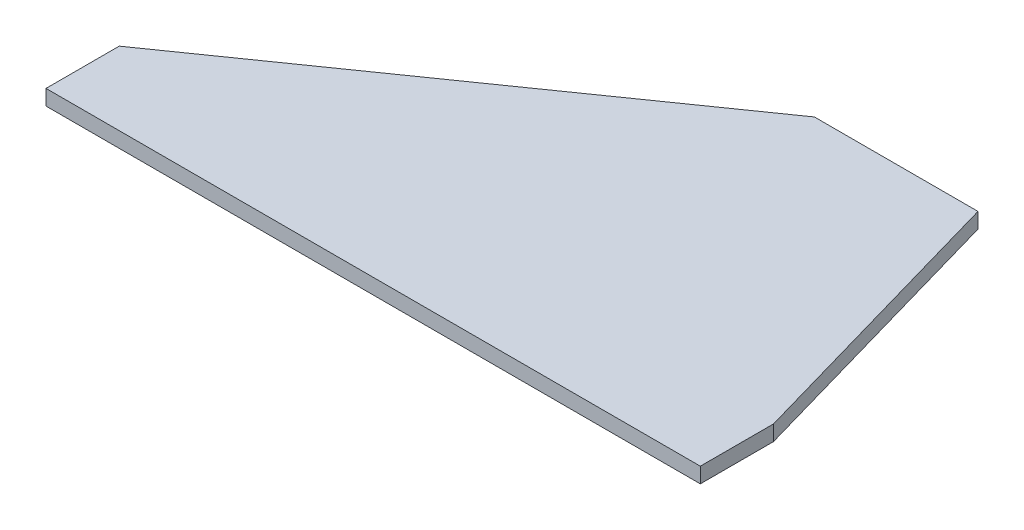
ISO-10303-21;
HEADER;
FILE_DESCRIPTION(('STEP AP214'),'2;1');
FILE_NAME('part.step','',(''),(''),'','','');
FILE_SCHEMA(('AUTOMOTIVE_DESIGN { 1 0 10303 214 1 1 1 1 }'));
ENDSEC;
DATA;
#1=APPLICATION_CONTEXT('core data for automotive mechanical design processes');
#2=APPLICATION_PROTOCOL_DEFINITION('international standard','automotive_design',2000,#1);
#3=PRODUCT_CONTEXT('',#1,'mechanical');
#4=PRODUCT('Part','Part','',(#3));
#5=PRODUCT_RELATED_PRODUCT_CATEGORY('part','',(#4));
#6=PRODUCT_DEFINITION_FORMATION('','',#4);
#7=PRODUCT_DEFINITION_CONTEXT('part definition',#1,'design');
#8=PRODUCT_DEFINITION('design','',#6,#7);
#9=PRODUCT_DEFINITION_SHAPE('','',#8);
#10=(LENGTH_UNIT() NAMED_UNIT(*) SI_UNIT(.MILLI.,.METRE.));
#11=(NAMED_UNIT(*) PLANE_ANGLE_UNIT() SI_UNIT($,.RADIAN.));
#12=(NAMED_UNIT(*) SI_UNIT($,.STERADIAN.) SOLID_ANGLE_UNIT());
#13=UNCERTAINTY_MEASURE_WITH_UNIT(LENGTH_MEASURE(1.E-05),#10,'distance_accuracy_value','');
#14=(GEOMETRIC_REPRESENTATION_CONTEXT(3) GLOBAL_UNCERTAINTY_ASSIGNED_CONTEXT((#13)) GLOBAL_UNIT_ASSIGNED_CONTEXT((#10,
#11,#12)) REPRESENTATION_CONTEXT('',''));
#15=CARTESIAN_POINT('',(0.,0.,0.));
#16=DIRECTION('',(0.,0.,1.));
#17=DIRECTION('',(1.,0.,0.));
#18=AXIS2_PLACEMENT_3D('',#15,#16,#17);
#19=CARTESIAN_POINT('',(127.,-2.38125,-111.633));
#20=DIRECTION('',(0.,0.,1.));
#21=DIRECTION('',(1.,0.,0.));
#22=AXIS2_PLACEMENT_3D('',#19,#20,#21);
#23=PLANE('',#22);
#24=DIRECTION('',(0.,1.,0.));
#25=VECTOR('',#24,1.);
#26=CARTESIAN_POINT('',(127.,-2.38125,-111.633));
#27=LINE('',#26,#25);
#28=CARTESIAN_POINT('',(127.,-2.38125,-111.633));
#29=VERTEX_POINT('',#28);
#30=CARTESIAN_POINT('',(127.,2.38125,-111.633));
#31=VERTEX_POINT('',#30);
#32=EDGE_CURVE('E103',#29,#31,#27,.T.);
#33=ORIENTED_EDGE('',*,*,#32,.T.);
#34=DIRECTION('',(1.,0.,0.));
#35=VECTOR('',#34,1.);
#36=CARTESIAN_POINT('',(127.,2.38125,-111.633));
#37=LINE('',#36,#35);
#38=CARTESIAN_POINT('',(177.8,2.38125,-111.633));
#39=VERTEX_POINT('',#38);
#40=EDGE_CURVE('E97',#31,#39,#37,.T.);
#41=ORIENTED_EDGE('',*,*,#40,.T.);
#42=DIRECTION('',(0.,1.,0.));
#43=VECTOR('',#42,1.);
#44=CARTESIAN_POINT('',(177.8,-2.38125,-111.633));
#45=LINE('',#44,#43);
#46=CARTESIAN_POINT('',(177.8,-2.38125,-111.633));
#47=VERTEX_POINT('',#46);
#48=EDGE_CURVE('E11',#47,#39,#45,.T.);
#49=ORIENTED_EDGE('',*,*,#48,.F.);
#50=DIRECTION('',(1.,0.,0.));
#51=VECTOR('',#50,1.);
#52=CARTESIAN_POINT('',(127.,-2.38125,-111.633));
#53=LINE('',#52,#51);
#54=EDGE_CURVE('E115',#29,#47,#53,.T.);
#55=ORIENTED_EDGE('',*,*,#54,.F.);
#56=EDGE_LOOP('',(#33,#41,#49,#55));
#57=FACE_BOUND('',#56,.T.);
#58=ADVANCED_FACE('F33',(#57),#23,.F.);
#59=CARTESIAN_POINT('',(177.8,-2.38125,-111.633));
#60=DIRECTION('',(-0.961523947640823,0.,0.274721127897378));
#61=DIRECTION('',(0.274721127897378,0.,0.961523947640823));
#62=AXIS2_PLACEMENT_3D('',#59,#60,#61);
#63=PLANE('',#62);
#64=ORIENTED_EDGE('',*,*,#48,.T.);
#65=DIRECTION('',(0.274721127897378,0.,0.961523947640823));
#66=VECTOR('',#65,1.);
#67=CARTESIAN_POINT('',(177.8,2.38125,-111.633));
#68=LINE('',#67,#66);
#69=CARTESIAN_POINT('',(203.2,2.38125,-22.733));
#70=VERTEX_POINT('',#69);
#71=EDGE_CURVE('E87',#39,#70,#68,.T.);
#72=ORIENTED_EDGE('',*,*,#71,.T.);
#73=DIRECTION('',(0.,1.,0.));
#74=VECTOR('',#73,1.);
#75=CARTESIAN_POINT('',(203.2,-2.38125,-22.733));
#76=LINE('',#75,#74);
#77=CARTESIAN_POINT('',(203.2,-2.38125,-22.733));
#78=VERTEX_POINT('',#77);
#79=EDGE_CURVE('E40',#78,#70,#76,.T.);
#80=ORIENTED_EDGE('',*,*,#79,.F.);
#81=DIRECTION('',(0.274721127897378,0.,0.961523947640823));
#82=VECTOR('',#81,1.);
#83=CARTESIAN_POINT('',(177.8,-2.38125,-111.633));
#84=LINE('',#83,#82);
#85=EDGE_CURVE('E88',#47,#78,#84,.T.);
#86=ORIENTED_EDGE('',*,*,#85,.F.);
#87=EDGE_LOOP('',(#64,#72,#80,#86));
#88=FACE_BOUND('',#87,.T.);
#89=ADVANCED_FACE('F85',(#88),#63,.F.);
#90=CARTESIAN_POINT('',(203.2,-2.38125,-22.733));
#91=DIRECTION('',(-1.,0.,0.));
#92=DIRECTION('',(0.,0.,1.));
#93=AXIS2_PLACEMENT_3D('',#90,#91,#92);
#94=PLANE('',#93);
#95=ORIENTED_EDGE('',*,*,#79,.T.);
#96=DIRECTION('',(0.,0.,1.));
#97=VECTOR('',#96,1.);
#98=CARTESIAN_POINT('',(203.2,2.38125,-22.733));
#99=LINE('',#98,#97);
#100=CARTESIAN_POINT('',(203.2,2.38125,0.));
#101=VERTEX_POINT('',#100);
#102=EDGE_CURVE('E101',#70,#101,#99,.T.);
#103=ORIENTED_EDGE('',*,*,#102,.T.);
#104=DIRECTION('',(0.,1.,0.));
#105=VECTOR('',#104,1.);
#106=CARTESIAN_POINT('',(203.2,-2.38125,0.));
#107=LINE('',#106,#105);
#108=CARTESIAN_POINT('',(203.2,-2.38125,0.));
#109=VERTEX_POINT('',#108);
#110=EDGE_CURVE('E129',#109,#101,#107,.T.);
#111=ORIENTED_EDGE('',*,*,#110,.F.);
#112=DIRECTION('',(0.,0.,1.));
#113=VECTOR('',#112,1.);
#114=CARTESIAN_POINT('',(203.2,-2.38125,-22.733));
#115=LINE('',#114,#113);
#116=EDGE_CURVE('E118',#78,#109,#115,.T.);
#117=ORIENTED_EDGE('',*,*,#116,.F.);
#118=EDGE_LOOP('',(#95,#103,#111,#117));
#119=FACE_BOUND('',#118,.T.);
#120=ADVANCED_FACE('F132',(#119),#94,.F.);
#121=CARTESIAN_POINT('',(203.2,-2.38125,0.));
#122=DIRECTION('',(0.,0.,-1.));
#123=DIRECTION('',(-1.,0.,0.));
#124=AXIS2_PLACEMENT_3D('',#121,#122,#123);
#125=PLANE('',#124);
#126=ORIENTED_EDGE('',*,*,#110,.T.);
#127=DIRECTION('',(-1.,0.,0.));
#128=VECTOR('',#127,1.);
#129=CARTESIAN_POINT('',(203.2,2.38125,0.));
#130=LINE('',#129,#128);
#131=CARTESIAN_POINT('',(0.,2.38125,0.));
#132=VERTEX_POINT('',#131);
#133=EDGE_CURVE('E107',#101,#132,#130,.T.);
#134=ORIENTED_EDGE('',*,*,#133,.T.);
#135=DIRECTION('',(0.,1.,0.));
#136=VECTOR('',#135,1.);
#137=CARTESIAN_POINT('',(0.,-2.38125,0.));
#138=LINE('',#137,#136);
#139=CARTESIAN_POINT('',(0.,-2.38125,0.));
#140=VERTEX_POINT('',#139);
#141=EDGE_CURVE('E127',#140,#132,#138,.T.);
#142=ORIENTED_EDGE('',*,*,#141,.F.);
#143=DIRECTION('',(-1.,0.,0.));
#144=VECTOR('',#143,1.);
#145=CARTESIAN_POINT('',(203.2,-2.38125,0.));
#146=LINE('',#145,#144);
#147=EDGE_CURVE('E120',#109,#140,#146,.T.);
#148=ORIENTED_EDGE('',*,*,#147,.F.);
#149=EDGE_LOOP('',(#126,#134,#142,#148));
#150=FACE_BOUND('',#149,.T.);
#151=ADVANCED_FACE('F138',(#150),#125,.F.);
#152=CARTESIAN_POINT('',(0.,-2.38125,0.));
#153=DIRECTION('',(1.,0.,0.));
#154=DIRECTION('',(0.,0.,-1.));
#155=AXIS2_PLACEMENT_3D('',#152,#153,#154);
#156=PLANE('',#155);
#157=ORIENTED_EDGE('',*,*,#141,.T.);
#158=DIRECTION('',(0.,0.,-1.));
#159=VECTOR('',#158,1.);
#160=CARTESIAN_POINT('',(0.,2.38125,0.));
#161=LINE('',#160,#159);
#162=CARTESIAN_POINT('',(0.,2.38125,-22.733));
#163=VERTEX_POINT('',#162);
#164=EDGE_CURVE('E110',#132,#163,#161,.T.);
#165=ORIENTED_EDGE('',*,*,#164,.T.);
#166=DIRECTION('',(0.,1.,0.));
#167=VECTOR('',#166,1.);
#168=CARTESIAN_POINT('',(0.,-2.38125,-22.733));
#169=LINE('',#168,#167);
#170=CARTESIAN_POINT('',(0.,-2.38125,-22.733));
#171=VERTEX_POINT('',#170);
#172=EDGE_CURVE('E125',#171,#163,#169,.T.);
#173=ORIENTED_EDGE('',*,*,#172,.F.);
#174=DIRECTION('',(0.,0.,-1.));
#175=VECTOR('',#174,1.);
#176=CARTESIAN_POINT('',(0.,-2.38125,0.));
#177=LINE('',#176,#175);
#178=EDGE_CURVE('E52',#140,#171,#177,.T.);
#179=ORIENTED_EDGE('',*,*,#178,.F.);
#180=EDGE_LOOP('',(#157,#165,#173,#179));
#181=FACE_BOUND('',#180,.T.);
#182=ADVANCED_FACE('F141',(#181),#156,.F.);
#183=CARTESIAN_POINT('',(0.,-2.38125,-22.733));
#184=DIRECTION('',(0.573462344363328,0.,0.81923192051904));
#185=DIRECTION('',(0.81923192051904,0.,-0.573462344363328));
#186=AXIS2_PLACEMENT_3D('',#183,#184,#185);
#187=PLANE('',#186);
#188=ORIENTED_EDGE('',*,*,#172,.T.);
#189=DIRECTION('',(0.81923192051904,0.,-0.573462344363328));
#190=VECTOR('',#189,1.);
#191=CARTESIAN_POINT('',(0.,2.38125,-22.733));
#192=LINE('',#191,#190);
#193=EDGE_CURVE('E113',#163,#31,#192,.T.);
#194=ORIENTED_EDGE('',*,*,#193,.T.);
#195=ORIENTED_EDGE('',*,*,#32,.F.);
#196=DIRECTION('',(0.81923192051904,0.,-0.573462344363328));
#197=VECTOR('',#196,1.);
#198=CARTESIAN_POINT('',(0.,-2.38125,-22.733));
#199=LINE('',#198,#197);
#200=EDGE_CURVE('E47',#171,#29,#199,.T.);
#201=ORIENTED_EDGE('',*,*,#200,.F.);
#202=EDGE_LOOP('',(#188,#194,#195,#201));
#203=FACE_BOUND('',#202,.T.);
#204=ADVANCED_FACE('F143',(#203),#187,.F.);
#205=CARTESIAN_POINT('',(0.,-2.38125,0.));
#206=DIRECTION('',(0.,-1.,0.));
#207=DIRECTION('',(0.,0.,-1.));
#208=AXIS2_PLACEMENT_3D('',#205,#206,#207);
#209=PLANE('',#208);
#210=ORIENTED_EDGE('',*,*,#54,.T.);
#211=ORIENTED_EDGE('',*,*,#85,.T.);
#212=ORIENTED_EDGE('',*,*,#116,.T.);
#213=ORIENTED_EDGE('',*,*,#147,.T.);
#214=ORIENTED_EDGE('',*,*,#178,.T.);
#215=ORIENTED_EDGE('',*,*,#200,.T.);
#216=EDGE_LOOP('',(#210,#211,#212,#213,#214,#215));
#217=FACE_BOUND('',#216,.T.);
#218=ADVANCED_FACE('F135',(#217),#209,.T.);
#219=CARTESIAN_POINT('',(0.,2.38125,0.));
#220=DIRECTION('',(0.,-1.,0.));
#221=DIRECTION('',(0.,0.,-1.));
#222=AXIS2_PLACEMENT_3D('',#219,#220,#221);
#223=PLANE('',#222);
#224=ORIENTED_EDGE('',*,*,#40,.F.);
#225=ORIENTED_EDGE('',*,*,#193,.F.);
#226=ORIENTED_EDGE('',*,*,#164,.F.);
#227=ORIENTED_EDGE('',*,*,#133,.F.);
#228=ORIENTED_EDGE('',*,*,#102,.F.);
#229=ORIENTED_EDGE('',*,*,#71,.F.);
#230=EDGE_LOOP('',(#224,#225,#226,#227,#228,#229));
#231=FACE_BOUND('',#230,.T.);
#232=ADVANCED_FACE('F95',(#231),#223,.F.);
#233=CLOSED_SHELL('',(#58,#89,#120,#151,#182,#204,#218,#232));
#234=MANIFOLD_SOLID_BREP('B2',#233);
#235=ADVANCED_BREP_SHAPE_REPRESENTATION('',(#18,#234),#14);
#236=SHAPE_DEFINITION_REPRESENTATION(#9,#235);
ENDSEC;
END-ISO-10303-21;
